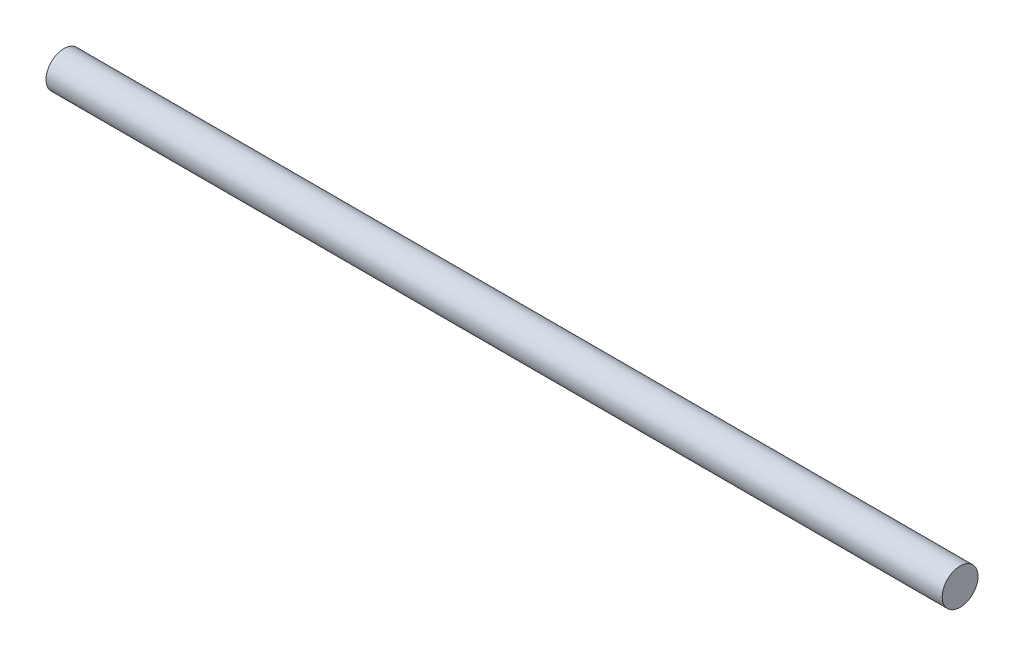
ISO-10303-21;
HEADER;
FILE_DESCRIPTION(('STEP AP214'),'2;1');
FILE_NAME('part.step','',(''),(''),'','','');
FILE_SCHEMA(('AUTOMOTIVE_DESIGN { 1 0 10303 214 1 1 1 1 }'));
ENDSEC;
DATA;
#1=APPLICATION_CONTEXT('core data for automotive mechanical design processes');
#2=APPLICATION_PROTOCOL_DEFINITION('international standard','automotive_design',2000,#1);
#3=PRODUCT_CONTEXT('',#1,'mechanical');
#4=PRODUCT('Part','Part','',(#3));
#5=PRODUCT_RELATED_PRODUCT_CATEGORY('part','',(#4));
#6=PRODUCT_DEFINITION_FORMATION('','',#4);
#7=PRODUCT_DEFINITION_CONTEXT('part definition',#1,'design');
#8=PRODUCT_DEFINITION('design','',#6,#7);
#9=PRODUCT_DEFINITION_SHAPE('','',#8);
#10=(LENGTH_UNIT() NAMED_UNIT(*) SI_UNIT(.MILLI.,.METRE.));
#11=(NAMED_UNIT(*) PLANE_ANGLE_UNIT() SI_UNIT($,.RADIAN.));
#12=(NAMED_UNIT(*) SI_UNIT($,.STERADIAN.) SOLID_ANGLE_UNIT());
#13=UNCERTAINTY_MEASURE_WITH_UNIT(LENGTH_MEASURE(1.E-05),#10,'distance_accuracy_value','');
#14=(GEOMETRIC_REPRESENTATION_CONTEXT(3) GLOBAL_UNCERTAINTY_ASSIGNED_CONTEXT((#13)) GLOBAL_UNIT_ASSIGNED_CONTEXT((#10,
#11,#12)) REPRESENTATION_CONTEXT('',''));
#15=CARTESIAN_POINT('',(0.,0.,0.));
#16=DIRECTION('',(0.,0.,1.));
#17=DIRECTION('',(1.,0.,0.));
#18=AXIS2_PLACEMENT_3D('',#15,#16,#17);
#19=CARTESIAN_POINT('',(-100.,0.,0.));
#20=DIRECTION('',(1.,0.,0.));
#21=DIRECTION('',(0.,0.,-1.));
#22=AXIS2_PLACEMENT_3D('',#19,#20,#21);
#23=PLANE('',#22);
#24=CARTESIAN_POINT('',(-100.,0.,0.));
#25=DIRECTION('',(-1.,0.,0.));
#26=DIRECTION('',(0.,0.,1.));
#27=AXIS2_PLACEMENT_3D('',#24,#25,#26);
#28=CIRCLE('',#27,4.);
#29=CARTESIAN_POINT('',(-100.,0.,4.));
#30=VERTEX_POINT('',#29);
#31=EDGE_CURVE('E10',#30,#30,#28,.T.);
#32=ORIENTED_EDGE('',*,*,#31,.T.);
#33=EDGE_LOOP('',(#32));
#34=FACE_BOUND('',#33,.T.);
#35=ADVANCED_FACE('F39',(#34),#23,.F.);
#36=CARTESIAN_POINT('',(-100.,0.,0.));
#37=DIRECTION('',(-1.,0.,0.));
#38=DIRECTION('',(0.,0.,1.));
#39=AXIS2_PLACEMENT_3D('',#36,#37,#38);
#40=CYLINDRICAL_SURFACE('',#39,4.);
#41=ORIENTED_EDGE('',*,*,#31,.F.);
#42=EDGE_LOOP('',(#41));
#43=FACE_BOUND('',#42,.T.);
#44=CARTESIAN_POINT('',(100.,0.,0.));
#45=DIRECTION('',(-1.,0.,0.));
#46=DIRECTION('',(0.,0.,1.));
#47=AXIS2_PLACEMENT_3D('',#44,#45,#46);
#48=CIRCLE('',#47,4.);
#49=CARTESIAN_POINT('',(100.,0.,4.));
#50=VERTEX_POINT('',#49);
#51=EDGE_CURVE('E46',#50,#50,#48,.T.);
#52=ORIENTED_EDGE('',*,*,#51,.T.);
#53=EDGE_LOOP('',(#52));
#54=FACE_BOUND('',#53,.T.);
#55=ADVANCED_FACE('F53',(#43,#54),#40,.T.);
#56=CARTESIAN_POINT('',(100.,4.,0.));
#57=DIRECTION('',(-1.,0.,0.));
#58=DIRECTION('',(0.,0.,1.));
#59=AXIS2_PLACEMENT_3D('',#56,#57,#58);
#60=PLANE('',#59);
#61=ORIENTED_EDGE('',*,*,#51,.F.);
#62=EDGE_LOOP('',(#61));
#63=FACE_BOUND('',#62,.T.);
#64=ADVANCED_FACE('F55',(#63),#60,.F.);
#65=CLOSED_SHELL('',(#35,#55,#64));
#66=MANIFOLD_SOLID_BREP('B2',#65);
#67=ADVANCED_BREP_SHAPE_REPRESENTATION('',(#18,#66),#14);
#68=SHAPE_DEFINITION_REPRESENTATION(#9,#67);
ENDSEC;
END-ISO-10303-21;
